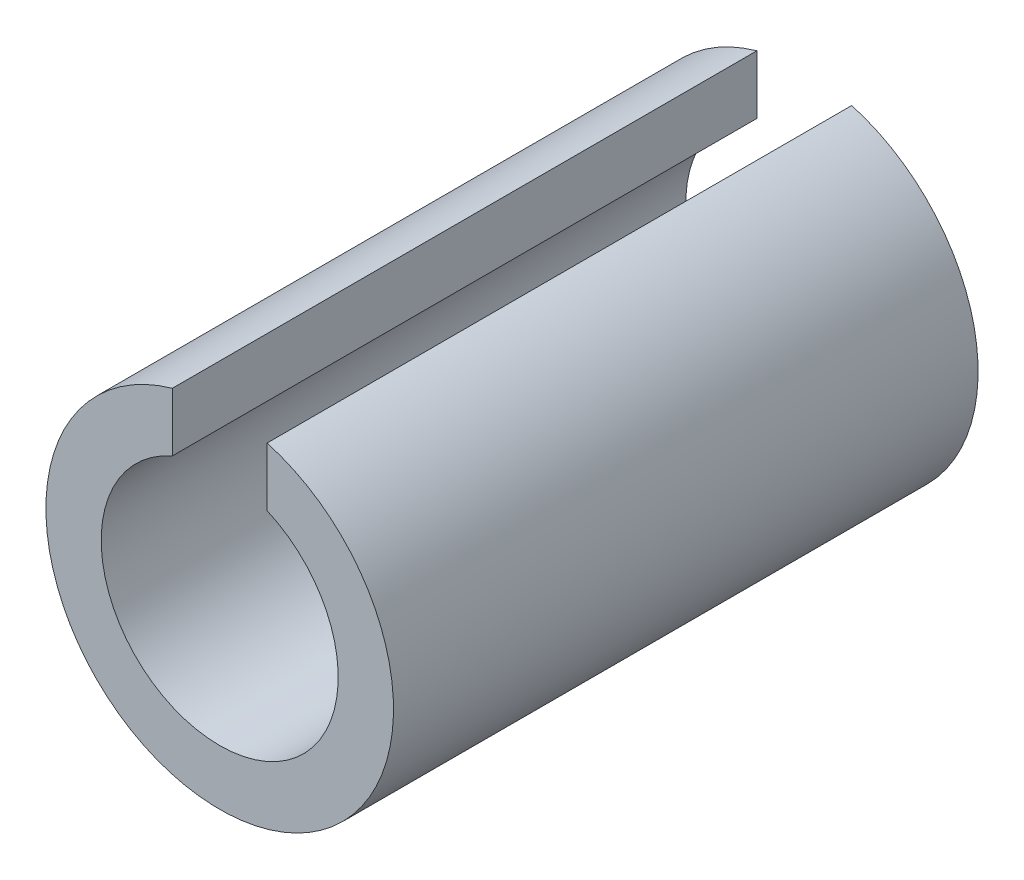
ISO-10303-21;
HEADER;
FILE_DESCRIPTION(('STEP AP214'),'2;1');
FILE_NAME('part.step','',(''),(''),'','','');
FILE_SCHEMA(('AUTOMOTIVE_DESIGN { 1 0 10303 214 1 1 1 1 }'));
ENDSEC;
DATA;
#1=APPLICATION_CONTEXT('core data for automotive mechanical design processes');
#2=APPLICATION_PROTOCOL_DEFINITION('international standard','automotive_design',2000,#1);
#3=PRODUCT_CONTEXT('',#1,'mechanical');
#4=PRODUCT('Part','Part','',(#3));
#5=PRODUCT_RELATED_PRODUCT_CATEGORY('part','',(#4));
#6=PRODUCT_DEFINITION_FORMATION('','',#4);
#7=PRODUCT_DEFINITION_CONTEXT('part definition',#1,'design');
#8=PRODUCT_DEFINITION('design','',#6,#7);
#9=PRODUCT_DEFINITION_SHAPE('','',#8);
#10=(LENGTH_UNIT() NAMED_UNIT(*) SI_UNIT(.MILLI.,.METRE.));
#11=(NAMED_UNIT(*) PLANE_ANGLE_UNIT() SI_UNIT($,.RADIAN.));
#12=(NAMED_UNIT(*) SI_UNIT($,.STERADIAN.) SOLID_ANGLE_UNIT());
#13=UNCERTAINTY_MEASURE_WITH_UNIT(LENGTH_MEASURE(1.E-05),#10,'distance_accuracy_value','');
#14=(GEOMETRIC_REPRESENTATION_CONTEXT(3) GLOBAL_UNCERTAINTY_ASSIGNED_CONTEXT((#13)) GLOBAL_UNIT_ASSIGNED_CONTEXT((#10,
#11,#12)) REPRESENTATION_CONTEXT('',''));
#15=CARTESIAN_POINT('',(0.,0.,0.));
#16=DIRECTION('',(0.,0.,1.));
#17=DIRECTION('',(1.,0.,0.));
#18=AXIS2_PLACEMENT_3D('',#15,#16,#17);
#19=CARTESIAN_POINT('',(0.,0.,-123.819249104637));
#20=DIRECTION('',(0.,0.,0.999999999999998));
#21=DIRECTION('',(1.,0.,0.));
#22=AXIS2_PLACEMENT_3D('',#19,#20,#21);
#23=CYLINDRICAL_SURFACE('',#22,7.5);
#24=CARTESIAN_POINT('',(0.,0.,-37.));
#25=DIRECTION('',(0.,0.,0.999999999999998));
#26=DIRECTION('',(1.,0.,0.));
#27=AXIS2_PLACEMENT_3D('',#24,#25,#26);
#28=CIRCLE('',#27,7.5);
#29=CARTESIAN_POINT('',(-3.,6.87386354243377,-37.));
#30=VERTEX_POINT('',#29);
#31=CARTESIAN_POINT('',(3.,6.87386354243377,-37.0000000000002));
#32=VERTEX_POINT('',#31);
#33=EDGE_CURVE('E134',#30,#32,#28,.T.);
#34=ORIENTED_EDGE('',*,*,#33,.F.);
#35=DIRECTION('',(0.,0.,0.999999999999998));
#36=VECTOR('',#35,1.);
#37=CARTESIAN_POINT('',(-3.00000000000011,6.87386354243386,-123.819249104637));
#38=LINE('',#37,#36);
#39=CARTESIAN_POINT('',(-3.,6.87386354243378,-2.22044604925031E-13));
#40=VERTEX_POINT('',#39);
#41=EDGE_CURVE('E148',#30,#40,#38,.T.);
#42=ORIENTED_EDGE('',*,*,#41,.T.);
#43=CARTESIAN_POINT('',(0.,0.,0.));
#44=DIRECTION('',(0.,0.,-0.999999999999998));
#45=DIRECTION('',(1.,0.,0.));
#46=AXIS2_PLACEMENT_3D('',#43,#44,#45);
#47=CIRCLE('',#46,7.5);
#48=CARTESIAN_POINT('',(2.99999999999995,6.87386354243393,-2.22044604925031E-13));
#49=VERTEX_POINT('',#48);
#50=EDGE_CURVE('E125',#49,#40,#47,.T.);
#51=ORIENTED_EDGE('',*,*,#50,.F.);
#52=DIRECTION('',(0.,0.,0.999999999999998));
#53=VECTOR('',#52,1.);
#54=CARTESIAN_POINT('',(3.,6.8738635424339,-123.819249104637));
#55=LINE('',#54,#53);
#56=EDGE_CURVE('E132',#32,#49,#55,.T.);
#57=ORIENTED_EDGE('',*,*,#56,.F.);
#58=EDGE_LOOP('',(#34,#42,#51,#57));
#59=FACE_BOUND('',#58,.T.);
#60=ADVANCED_FACE('F36',(#59),#23,.F.);
#61=CARTESIAN_POINT('',(3.,6.8738635424339,-123.819249104637));
#62=DIRECTION('',(-1.,0.,0.));
#63=DIRECTION('',(0.,0.,0.999999999999998));
#64=AXIS2_PLACEMENT_3D('',#61,#62,#63);
#65=PLANE('',#64);
#66=DIRECTION('',(0.,1.,0.));
#67=VECTOR('',#66,1.);
#68=CARTESIAN_POINT('',(3.,6.87386354243377,-37.0000000000002));
#69=LINE('',#68,#67);
#70=CARTESIAN_POINT('',(3.,10.5830052442584,-37.));
#71=VERTEX_POINT('',#70);
#72=EDGE_CURVE('E58',#32,#71,#69,.T.);
#73=ORIENTED_EDGE('',*,*,#72,.F.);
#74=ORIENTED_EDGE('',*,*,#56,.T.);
#75=DIRECTION('',(0.,-1.,0.));
#76=VECTOR('',#75,1.);
#77=CARTESIAN_POINT('',(2.99999999999995,6.87386354243393,-2.22044604925031E-13));
#78=LINE('',#77,#76);
#79=CARTESIAN_POINT('',(2.99999999999998,10.5830052442586,-2.22044604925031E-13));
#80=VERTEX_POINT('',#79);
#81=EDGE_CURVE('E145',#80,#49,#78,.T.);
#82=ORIENTED_EDGE('',*,*,#81,.F.);
#83=DIRECTION('',(0.,0.,0.999999999999998));
#84=VECTOR('',#83,1.);
#85=CARTESIAN_POINT('',(2.99999999999986,10.5830052442585,-123.819249104637));
#86=LINE('',#85,#84);
#87=EDGE_CURVE('E150',#71,#80,#86,.T.);
#88=ORIENTED_EDGE('',*,*,#87,.F.);
#89=EDGE_LOOP('',(#73,#74,#82,#88));
#90=FACE_BOUND('',#89,.T.);
#91=ADVANCED_FACE('F194',(#90),#65,.T.);
#92=CARTESIAN_POINT('',(0.,0.,-123.819249104637));
#93=DIRECTION('',(0.,0.,0.999999999999998));
#94=DIRECTION('',(1.,0.,0.));
#95=AXIS2_PLACEMENT_3D('',#92,#93,#94);
#96=CYLINDRICAL_SURFACE('',#95,11.);
#97=CARTESIAN_POINT('',(2.99999999999992,-10.5830052442585,-6.00000000000001));
#98=CARTESIAN_POINT('',(3.00000989976806,-10.5829949970027,-5.91730610859018));
#99=CARTESIAN_POINT('',(2.99658102723594,-10.5839742471726,-5.83461829540796));
#100=CARTESIAN_POINT('',(2.98292268314841,-10.5878356752193,-5.66986643377116));
#101=CARTESIAN_POINT('',(2.97269452008914,-10.5907174869552,-5.58780226837092));
#102=CARTESIAN_POINT('',(2.9455445902732,-10.598299618142,-5.42505748785523));
#103=CARTESIAN_POINT('',(2.9286377012691,-10.6029958951229,-5.34437421061366));
#104=CARTESIAN_POINT('',(2.88829120712689,-10.6140571066224,-5.18479674594573));
#105=CARTESIAN_POINT('',(2.86485147768949,-10.6204220728906,-5.10590259259162));
#106=CARTESIAN_POINT('',(2.78500332821791,-10.6417494872311,-4.872757092836));
#107=CARTESIAN_POINT('',(2.71903526586306,-10.6589535681767,-4.72186060514475));
#108=CARTESIAN_POINT('',(2.56365897700126,-10.6973836998985,-4.43329465823132));
#109=CARTESIAN_POINT('',(2.47424245636572,-10.7186111730806,-4.29562990289597));
#110=CARTESIAN_POINT('',(2.27200424315807,-10.7633148792344,-4.0337902940215));
#111=CARTESIAN_POINT('',(2.15868225262837,-10.7868322128172,-3.91000812175632));
#112=CARTESIAN_POINT('',(1.91292298422353,-10.8331129950831,-3.68294856109473));
#113=CARTESIAN_POINT('',(1.78048258944449,-10.8558763200935,-3.57967452270677));
#114=CARTESIAN_POINT('',(1.49749198480948,-10.8985459264206,-3.39490109325356));
#115=CARTESIAN_POINT('',(1.34667477161621,-10.9183977479742,-3.31379692017903));
#116=CARTESIAN_POINT('',(1.03291980522386,-10.9525311229674,-3.17825158622032));
#117=CARTESIAN_POINT('',(0.869984764533397,-10.9668139185607,-3.12380447886812));
#118=CARTESIAN_POINT('',(0.54074467589672,-10.9879090070619,-3.04439826509732));
#119=CARTESIAN_POINT('',(0.374613167612536,-10.9948916417093,-3.01876567363063));
#120=CARTESIAN_POINT('',(0.040267381362016,-11.0011960589752,-2.99559533515301));
#121=CARTESIAN_POINT('',(-0.127946573564705,-11.0005190152883,-2.99805328382166));
#122=CARTESIAN_POINT('',(-0.456980924404269,-10.9917041066205,-3.0305248758153));
#123=CARTESIAN_POINT('',(-0.617879308918099,-10.9837634920705,-3.05981002677335));
#124=CARTESIAN_POINT('',(-0.932383527853156,-10.9615477415639,-3.14392521585876));
#125=CARTESIAN_POINT('',(-1.085989008539,-10.9472722986892,-3.19875649168473));
#126=CARTESIAN_POINT('',(-1.38338788045078,-10.9137016176963,-3.33295486680702));
#127=CARTESIAN_POINT('',(-1.52706425574146,-10.8943563157114,-3.41256824623877));
#128=CARTESIAN_POINT('',(-1.79926098198645,-10.8527253375081,-3.59387986990654));
#129=CARTESIAN_POINT('',(-1.92777854091955,-10.830439121215,-3.69558217281222));
#130=CARTESIAN_POINT('',(-2.17034844112029,-10.7844948742977,-3.92202323508377));
#131=CARTESIAN_POINT('',(-2.2838069302889,-10.760815765188,-4.04739455386902));
#132=CARTESIAN_POINT('',(-2.48826234185507,-10.7153886222241,-4.31566238087014));
#133=CARTESIAN_POINT('',(-2.57925300980784,-10.6936411271564,-4.45856375245396));
#134=CARTESIAN_POINT('',(-2.73667910615421,-10.6544469945807,-4.75919481275405));
#135=CARTESIAN_POINT('',(-2.8029322389078,-10.6370325899538,-4.91702424275709));
#136=CARTESIAN_POINT('',(-2.90768324325786,-10.6088816209578,-5.24208709452696));
#137=CARTESIAN_POINT('',(-2.9462229136238,-10.5981350032859,-5.40930594227503));
#138=CARTESIAN_POINT('',(-2.98015870664216,-10.588613232355,-5.64835443986661));
#139=CARTESIAN_POINT('',(-2.98759962141263,-10.5865140551644,-5.71851645972366));
#140=CARTESIAN_POINT('',(-2.99751512863219,-10.5837103518601,-5.85910755324028));
#141=CARTESIAN_POINT('',(-2.99999749605756,-10.5830036423878,-5.92953603505849));
#142=CARTESIAN_POINT('',(-3.00000000000014,-10.5830052442584,-6.00000000000001));
#143=B_SPLINE_CURVE_WITH_KNOTS('',3,(#97,#98,#99,#100,#101,#102,#103,#104,#105,#106,#107,#108,
#109,#110,#111,#112,#113,#114,#115,#116,#117,#118,#119,#120,#121,#122,#123,#124,#125,#126,#127,
#128,#129,#130,#131,#132,#133,#134,#135,#136,#137,#138,#139,#140,#141,#142),.UNSPECIFIED.,.F.,
.F.,(4,2,2,2,2,2,2,2,2,2,2,2,2,2,2,2,2,2,2,2,2,2,4),(0.,0.247994395628701,0.495941079544128,
0.743338515979068,0.990740659926208,1.48499724217183,1.97942888795731,2.48547083856629,
2.99159538337131,3.5062279498187,4.02074566333956,4.52296979924472,5.0251169802535,
5.51402000992995,6.00294672920888,6.49689640600089,6.99093691914146,7.50077286033219,
8.01075056671344,8.52441550873709,9.03730408243459,9.24891043373583,9.4601847261122),.UNSPECIFIED.);
#144=CARTESIAN_POINT('',(3.,-10.5830052442584,-6.00000000000001));
#145=VERTEX_POINT('',#144);
#146=CARTESIAN_POINT('',(-3.00000000000014,-10.5830052442584,-6.00000000000001));
#147=VERTEX_POINT('',#146);
#148=EDGE_CURVE('E156',#145,#147,#143,.T.);
#149=ORIENTED_EDGE('',*,*,#148,.F.);
#150=DIRECTION('',(0.,0.,0.999999999999998));
#151=VECTOR('',#150,1.);
#152=CARTESIAN_POINT('',(3.,-10.5830052442583,-123.819249104637));
#153=LINE('',#152,#151);
#154=CARTESIAN_POINT('',(3.,-10.5830052442584,-31.));
#155=VERTEX_POINT('',#154);
#156=EDGE_CURVE('E11',#155,#145,#153,.T.);
#157=ORIENTED_EDGE('',*,*,#156,.F.);
#158=CARTESIAN_POINT('',(-3.00000000000011,-10.5830052442584,-31.));
#159=CARTESIAN_POINT('',(-3.00000989976821,-10.5829949970026,-31.0826938914098));
#160=CARTESIAN_POINT('',(-2.99658102723606,-10.5839742471726,-31.165381704592));
#161=CARTESIAN_POINT('',(-2.98292268314851,-10.5878356752193,-31.3301335662288));
#162=CARTESIAN_POINT('',(-2.97269452008924,-10.5907174869551,-31.4121977316291));
#163=CARTESIAN_POINT('',(-2.94554459027332,-10.5982996181419,-31.5749425121448));
#164=CARTESIAN_POINT('',(-2.92863770126923,-10.6029958951229,-31.6556257893863));
#165=CARTESIAN_POINT('',(-2.88829120712698,-10.6140571066224,-31.8152032540543));
#166=CARTESIAN_POINT('',(-2.86485147768953,-10.6204220728906,-31.8940974074084));
#167=CARTESIAN_POINT('',(-2.78500332821791,-10.6417494872311,-32.127242907164));
#168=CARTESIAN_POINT('',(-2.71903526586315,-10.6589535681767,-32.2781393948553));
#169=CARTESIAN_POINT('',(-2.56365897700135,-10.6973836998985,-32.5667053417687));
#170=CARTESIAN_POINT('',(-2.47424245636574,-10.7186111730805,-32.704370097104));
#171=CARTESIAN_POINT('',(-2.27200424315806,-10.7633148792343,-32.9662097059785));
#172=CARTESIAN_POINT('',(-2.15868225262842,-10.7868322128172,-33.0899918782437));
#173=CARTESIAN_POINT('',(-1.9129229842236,-10.8331129950831,-33.3170514389053));
#174=CARTESIAN_POINT('',(-1.78048258944453,-10.8558763200935,-33.4203254772932));
#175=CARTESIAN_POINT('',(-1.4974919848095,-10.8985459264206,-33.6050989067464));
#176=CARTESIAN_POINT('',(-1.34667477161625,-10.9183977479742,-33.686203079821));
#177=CARTESIAN_POINT('',(-1.0329198052239,-10.9525311229674,-33.8217484137797));
#178=CARTESIAN_POINT('',(-0.869984764533431,-10.9668139185607,-33.8761955211319));
#179=CARTESIAN_POINT('',(-0.540744675896746,-10.9879090070619,-33.9556017349027));
#180=CARTESIAN_POINT('',(-0.374613167612561,-10.9948916417093,-33.9812343263694));
#181=CARTESIAN_POINT('',(-0.0402673813620417,-11.0011960589752,-34.004404664847));
#182=CARTESIAN_POINT('',(0.127946573564679,-11.0005190152883,-34.0019467161783));
#183=CARTESIAN_POINT('',(0.456980924404218,-10.9917041066205,-33.9694751241847));
#184=CARTESIAN_POINT('',(0.617879308918024,-10.9837634920705,-33.9401899732266));
#185=CARTESIAN_POINT('',(0.932383527853034,-10.9615477415639,-33.8560747841412));
#186=CARTESIAN_POINT('',(1.08598900853885,-10.9472722986892,-33.8012435083152));
#187=CARTESIAN_POINT('',(1.38338788045063,-10.9137016176963,-33.6670451331929));
#188=CARTESIAN_POINT('',(1.52706425574132,-10.8943563157114,-33.5874317537612));
#189=CARTESIAN_POINT('',(1.79926098198635,-10.8527253375081,-33.4061201300934));
#190=CARTESIAN_POINT('',(1.92777854091949,-10.8304391212151,-33.3044178271878));
#191=CARTESIAN_POINT('',(2.17034844112023,-10.7844948742978,-33.0779767649162));
#192=CARTESIAN_POINT('',(2.2838069302888,-10.760815765188,-32.9526054461309));
#193=CARTESIAN_POINT('',(2.48826234185498,-10.7153886222241,-32.6843376191298));
#194=CARTESIAN_POINT('',(2.5792530098078,-10.6936411271563,-32.541436247546));
#195=CARTESIAN_POINT('',(2.73667910615419,-10.6544469945807,-32.240805187246));
#196=CARTESIAN_POINT('',(2.80293223890774,-10.6370325899538,-32.0829757572429));
#197=CARTESIAN_POINT('',(2.90768324325769,-10.6088816209578,-31.757912905473));
#198=CARTESIAN_POINT('',(2.94622291362356,-10.598135003286,-31.5906940577249));
#199=CARTESIAN_POINT('',(2.98015870664199,-10.588613232355,-31.3516455601334));
#200=CARTESIAN_POINT('',(2.9875996214125,-10.5865140551645,-31.2814835402763));
#201=CARTESIAN_POINT('',(2.9975151286321,-10.5837103518601,-31.1408924467597));
#202=CARTESIAN_POINT('',(2.99999749605747,-10.5830036423878,-31.0704639649415));
#203=CARTESIAN_POINT('',(3.,-10.5830052442584,-31.));
#204=B_SPLINE_CURVE_WITH_KNOTS('',3,(#158,#159,#160,#161,#162,#163,#164,#165,#166,#167,#168,
#169,#170,#171,#172,#173,#174,#175,#176,#177,#178,#179,#180,#181,#182,#183,#184,#185,#186,#187,
#188,#189,#190,#191,#192,#193,#194,#195,#196,#197,#198,#199,#200,#201,#202,#203),.UNSPECIFIED.,
.F.,.F.,(4,2,2,2,2,2,2,2,2,2,2,2,2,2,2,2,2,2,2,2,2,2,4),(0.,0.247994395628705,0.49594107954413,
0.743338515979084,0.990740659926236,1.48499724217187,1.97942888795736,2.48547083856634,
2.99159538337135,3.50622794981875,4.02074566333963,4.52296979924478,5.02511698025356,
5.51402000992994,6.0029467292088,6.49689640600086,6.99093691914146,7.50077286033219,
8.01075056671344,8.52441550873706,9.03730408243456,9.24891043373581,9.46018472611218),.UNSPECIFIED.);
#205=CARTESIAN_POINT('',(-3.00000000000011,-10.5830052442584,-31.));
#206=VERTEX_POINT('',#205);
#207=EDGE_CURVE('E43',#206,#155,#204,.T.);
#208=ORIENTED_EDGE('',*,*,#207,.F.);
#209=DIRECTION('',(0.,0.,0.999999999999998));
#210=VECTOR('',#209,1.);
#211=CARTESIAN_POINT('',(-2.99999999999998,-10.5830052442584,-123.819249104637));
#212=LINE('',#211,#210);
#213=EDGE_CURVE('E164',#147,#206,#212,.F.);
#214=ORIENTED_EDGE('',*,*,#213,.F.);
#215=EDGE_LOOP('',(#149,#157,#208,#214));
#216=FACE_BOUND('',#215,.T.);
#217=CARTESIAN_POINT('',(0.,0.,-37.));
#218=DIRECTION('',(0.,0.,0.999999999999998));
#219=DIRECTION('',(1.,0.,0.));
#220=AXIS2_PLACEMENT_3D('',#217,#218,#219);
#221=CIRCLE('',#220,11.);
#222=CARTESIAN_POINT('',(-3.00000000000003,10.5830052442584,-37.));
#223=VERTEX_POINT('',#222);
#224=EDGE_CURVE('E130',#71,#223,#221,.F.);
#225=ORIENTED_EDGE('',*,*,#224,.F.);
#226=ORIENTED_EDGE('',*,*,#87,.T.);
#227=CARTESIAN_POINT('',(0.,0.,0.));
#228=DIRECTION('',(0.,0.,0.999999999999998));
#229=DIRECTION('',(1.,0.,0.));
#230=AXIS2_PLACEMENT_3D('',#227,#228,#229);
#231=CIRCLE('',#230,11.);
#232=CARTESIAN_POINT('',(-3.,10.5830052442584,-2.22044604925031E-13));
#233=VERTEX_POINT('',#232);
#234=EDGE_CURVE('E142',#233,#80,#231,.T.);
#235=ORIENTED_EDGE('',*,*,#234,.F.);
#236=DIRECTION('',(0.,0.,0.999999999999998));
#237=VECTOR('',#236,1.);
#238=CARTESIAN_POINT('',(-3.,10.5830052442584,-123.819249104637));
#239=LINE('',#238,#237);
#240=EDGE_CURVE('E152',#223,#233,#239,.T.);
#241=ORIENTED_EDGE('',*,*,#240,.F.);
#242=EDGE_LOOP('',(#225,#226,#235,#241));
#243=FACE_BOUND('',#242,.T.);
#244=ADVANCED_FACE('F165',(#216,#243),#96,.T.);
#245=CARTESIAN_POINT('',(-3.00000000000011,6.87386354243386,-123.819249104637));
#246=DIRECTION('',(1.,0.,0.));
#247=DIRECTION('',(0.,0.,-0.999999999999998));
#248=AXIS2_PLACEMENT_3D('',#245,#246,#247);
#249=PLANE('',#248);
#250=DIRECTION('',(0.,-1.,0.));
#251=VECTOR('',#250,1.);
#252=CARTESIAN_POINT('',(-3.,6.87386354243377,-37.));
#253=LINE('',#252,#251);
#254=EDGE_CURVE('E136',#223,#30,#253,.T.);
#255=ORIENTED_EDGE('',*,*,#254,.F.);
#256=ORIENTED_EDGE('',*,*,#240,.T.);
#257=DIRECTION('',(0.,1.,0.));
#258=VECTOR('',#257,1.);
#259=CARTESIAN_POINT('',(-3.,6.87386354243378,-2.22044604925031E-13));
#260=LINE('',#259,#258);
#261=EDGE_CURVE('E139',#40,#233,#260,.T.);
#262=ORIENTED_EDGE('',*,*,#261,.F.);
#263=ORIENTED_EDGE('',*,*,#41,.F.);
#264=EDGE_LOOP('',(#255,#256,#262,#263));
#265=FACE_BOUND('',#264,.T.);
#266=ADVANCED_FACE('F193',(#265),#249,.T.);
#267=CARTESIAN_POINT('',(0.,0.,0.));
#268=DIRECTION('',(0.,0.,0.999999999999998));
#269=DIRECTION('',(1.,0.,0.));
#270=AXIS2_PLACEMENT_3D('',#267,#268,#269);
#271=PLANE('',#270);
#272=ORIENTED_EDGE('',*,*,#50,.T.);
#273=ORIENTED_EDGE('',*,*,#261,.T.);
#274=ORIENTED_EDGE('',*,*,#234,.T.);
#275=ORIENTED_EDGE('',*,*,#81,.T.);
#276=EDGE_LOOP('',(#272,#273,#274,#275));
#277=FACE_BOUND('',#276,.T.);
#278=ADVANCED_FACE('F204',(#277),#271,.T.);
#279=CARTESIAN_POINT('',(0.,25.,-37.));
#280=DIRECTION('',(0.,0.,0.999999999999998));
#281=DIRECTION('',(1.,0.,0.));
#282=AXIS2_PLACEMENT_3D('',#279,#280,#281);
#283=PLANE('',#282);
#284=ORIENTED_EDGE('',*,*,#33,.T.);
#285=ORIENTED_EDGE('',*,*,#72,.T.);
#286=ORIENTED_EDGE('',*,*,#224,.T.);
#287=ORIENTED_EDGE('',*,*,#254,.T.);
#288=EDGE_LOOP('',(#284,#285,#286,#287));
#289=FACE_BOUND('',#288,.T.);
#290=ADVANCED_FACE('F181',(#289),#283,.F.);
#291=CARTESIAN_POINT('',(-1.11022302462516E-13,-8.00000000000006,-31.));
#292=DIRECTION('',(0.,-1.,0.));
#293=DIRECTION('',(0.,0.,-0.999999999999998));
#294=AXIS2_PLACEMENT_3D('',#291,#292,#293);
#295=CYLINDRICAL_SURFACE('',#294,3.);
#296=DIRECTION('',(0.,-1.,0.));
#297=VECTOR('',#296,1.);
#298=CARTESIAN_POINT('',(-3.00000000000017,-8.00000000000002,-31.));
#299=LINE('',#298,#297);
#300=CARTESIAN_POINT('',(-3.00000000000017,-8.00000000000002,-31.));
#301=VERTEX_POINT('',#300);
#302=EDGE_CURVE('E123',#301,#206,#299,.T.);
#303=ORIENTED_EDGE('',*,*,#302,.T.);
#304=ORIENTED_EDGE('',*,*,#207,.T.);
#305=DIRECTION('',(0.,-1.,0.));
#306=VECTOR('',#305,1.);
#307=CARTESIAN_POINT('',(3.,-8.,-31.));
#308=LINE('',#307,#306);
#309=CARTESIAN_POINT('',(3.,-8.,-31.));
#310=VERTEX_POINT('',#309);
#311=EDGE_CURVE('E49',#310,#155,#308,.T.);
#312=ORIENTED_EDGE('',*,*,#311,.F.);
#313=CARTESIAN_POINT('',(-1.11022302462516E-13,-8.00000000000006,-31.));
#314=DIRECTION('',(0.,-1.,0.));
#315=DIRECTION('',(0.,0.,-0.999999999999998));
#316=AXIS2_PLACEMENT_3D('',#313,#314,#315);
#317=CIRCLE('',#316,3.);
#318=EDGE_CURVE('E102',#301,#310,#317,.T.);
#319=ORIENTED_EDGE('',*,*,#318,.F.);
#320=EDGE_LOOP('',(#303,#304,#312,#319));
#321=FACE_BOUND('',#320,.T.);
#322=ADVANCED_FACE('F100',(#321),#295,.F.);
#323=CARTESIAN_POINT('',(-3.00000000000017,-8.00000000000002,-31.));
#324=DIRECTION('',(-1.,0.,0.));
#325=DIRECTION('',(0.,0.,0.999999999999998));
#326=AXIS2_PLACEMENT_3D('',#323,#324,#325);
#327=PLANE('',#326);
#328=ORIENTED_EDGE('',*,*,#213,.T.);
#329=ORIENTED_EDGE('',*,*,#302,.F.);
#330=DIRECTION('',(0.,0.,-0.999999999999998));
#331=VECTOR('',#330,1.);
#332=CARTESIAN_POINT('',(-3.00000000000017,-8.00000000000002,-31.));
#333=LINE('',#332,#331);
#334=CARTESIAN_POINT('',(-3.,-8.00000000000001,-6.00000000000001));
#335=VERTEX_POINT('',#334);
#336=EDGE_CURVE('E106',#335,#301,#333,.T.);
#337=ORIENTED_EDGE('',*,*,#336,.F.);
#338=DIRECTION('',(0.,-1.,0.));
#339=VECTOR('',#338,1.);
#340=CARTESIAN_POINT('',(-3.,-8.00000000000001,-6.00000000000001));
#341=LINE('',#340,#339);
#342=EDGE_CURVE('E126',#335,#147,#341,.T.);
#343=ORIENTED_EDGE('',*,*,#342,.T.);
#344=EDGE_LOOP('',(#328,#329,#337,#343));
#345=FACE_BOUND('',#344,.T.);
#346=ADVANCED_FACE('F173',(#345),#327,.F.);
#347=CARTESIAN_POINT('',(0.,-8.00000000000007,-6.00000000000001));
#348=DIRECTION('',(0.,-1.,0.));
#349=DIRECTION('',(0.,0.,-0.999999999999998));
#350=AXIS2_PLACEMENT_3D('',#347,#348,#349);
#351=CYLINDRICAL_SURFACE('',#350,3.);
#352=DIRECTION('',(0.,-1.,0.));
#353=VECTOR('',#352,1.);
#354=CARTESIAN_POINT('',(3.,-8.00000000000001,-6.00000000000001));
#355=LINE('',#354,#353);
#356=CARTESIAN_POINT('',(3.,-8.00000000000001,-6.00000000000001));
#357=VERTEX_POINT('',#356);
#358=EDGE_CURVE('E105',#357,#145,#355,.T.);
#359=ORIENTED_EDGE('',*,*,#358,.T.);
#360=ORIENTED_EDGE('',*,*,#148,.T.);
#361=ORIENTED_EDGE('',*,*,#342,.F.);
#362=CARTESIAN_POINT('',(0.,-8.00000000000007,-6.00000000000001));
#363=DIRECTION('',(0.,-1.,0.));
#364=DIRECTION('',(0.,0.,-0.999999999999998));
#365=AXIS2_PLACEMENT_3D('',#362,#363,#364);
#366=CIRCLE('',#365,3.);
#367=EDGE_CURVE('E115',#357,#335,#366,.T.);
#368=ORIENTED_EDGE('',*,*,#367,.F.);
#369=EDGE_LOOP('',(#359,#360,#361,#368));
#370=FACE_BOUND('',#369,.T.);
#371=ADVANCED_FACE('F168',(#370),#351,.F.);
#372=CARTESIAN_POINT('',(3.,-8.,-31.));
#373=DIRECTION('',(1.,0.,0.));
#374=DIRECTION('',(0.,0.,-0.999999999999998));
#375=AXIS2_PLACEMENT_3D('',#372,#373,#374);
#376=PLANE('',#375);
#377=ORIENTED_EDGE('',*,*,#156,.T.);
#378=ORIENTED_EDGE('',*,*,#358,.F.);
#379=DIRECTION('',(0.,0.,0.999999999999998));
#380=VECTOR('',#379,1.);
#381=CARTESIAN_POINT('',(3.,-8.,-31.));
#382=LINE('',#381,#380);
#383=EDGE_CURVE('E109',#310,#357,#382,.T.);
#384=ORIENTED_EDGE('',*,*,#383,.F.);
#385=ORIENTED_EDGE('',*,*,#311,.T.);
#386=EDGE_LOOP('',(#377,#378,#384,#385));
#387=FACE_BOUND('',#386,.T.);
#388=ADVANCED_FACE('F110',(#387),#376,.F.);
#389=CARTESIAN_POINT('',(-1.11022302462516E-13,-8.00000000000006,-31.));
#390=DIRECTION('',(0.,-1.,0.));
#391=DIRECTION('',(0.,0.,-0.999999999999998));
#392=AXIS2_PLACEMENT_3D('',#389,#390,#391);
#393=PLANE('',#392);
#394=ORIENTED_EDGE('',*,*,#318,.T.);
#395=ORIENTED_EDGE('',*,*,#383,.T.);
#396=ORIENTED_EDGE('',*,*,#367,.T.);
#397=ORIENTED_EDGE('',*,*,#336,.T.);
#398=EDGE_LOOP('',(#394,#395,#396,#397));
#399=FACE_BOUND('',#398,.T.);
#400=ADVANCED_FACE('F117',(#399),#393,.T.);
#401=CLOSED_SHELL('',(#60,#91,#244,#266,#278,#290,#322,#346,#371,#388,#400));
#402=MANIFOLD_SOLID_BREP('B2',#401);
#403=ADVANCED_BREP_SHAPE_REPRESENTATION('',(#18,#402),#14);
#404=SHAPE_DEFINITION_REPRESENTATION(#9,#403);
ENDSEC;
END-ISO-10303-21;
